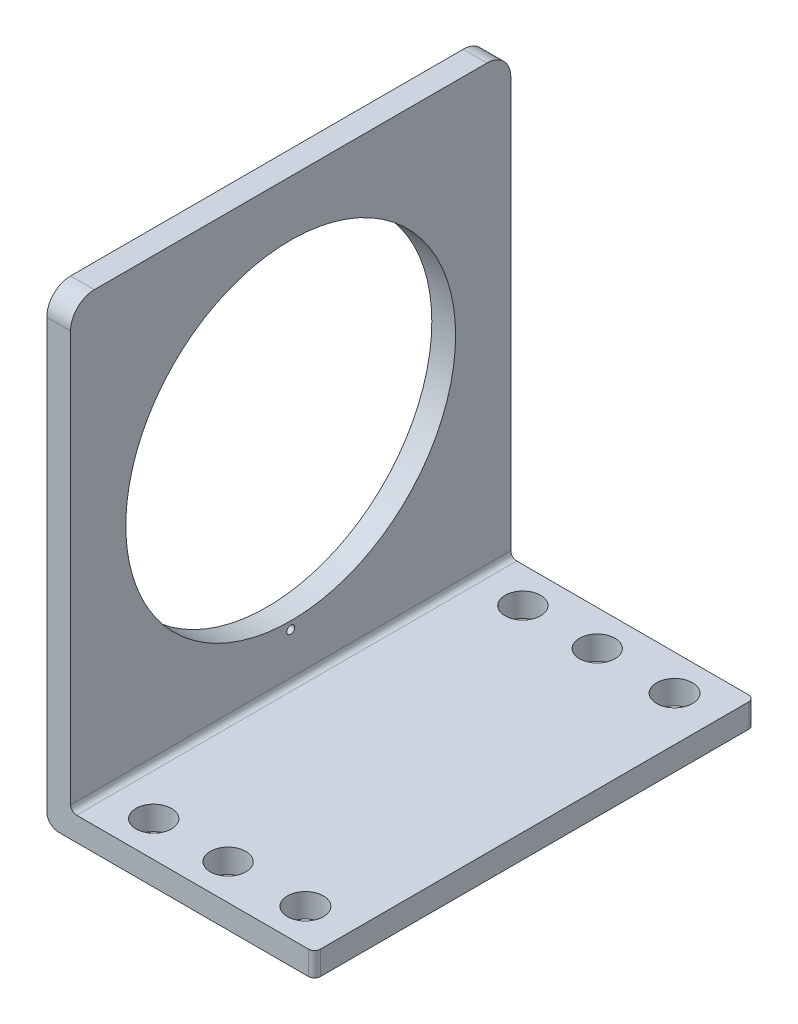
ISO-10303-21;
HEADER;
FILE_DESCRIPTION(('STEP AP214'),'2;1');
FILE_NAME('part.step','',(''),(''),'','','');
FILE_SCHEMA(('AUTOMOTIVE_DESIGN { 1 0 10303 214 1 1 1 1 }'));
ENDSEC;
DATA;
#1=APPLICATION_CONTEXT('core data for automotive mechanical design processes');
#2=APPLICATION_PROTOCOL_DEFINITION('international standard','automotive_design',2000,#1);
#3=PRODUCT_CONTEXT('',#1,'mechanical');
#4=PRODUCT('Part','Part','',(#3));
#5=PRODUCT_RELATED_PRODUCT_CATEGORY('part','',(#4));
#6=PRODUCT_DEFINITION_FORMATION('','',#4);
#7=PRODUCT_DEFINITION_CONTEXT('part definition',#1,'design');
#8=PRODUCT_DEFINITION('design','',#6,#7);
#9=PRODUCT_DEFINITION_SHAPE('','',#8);
#10=(LENGTH_UNIT() NAMED_UNIT(*) SI_UNIT(.MILLI.,.METRE.));
#11=(NAMED_UNIT(*) PLANE_ANGLE_UNIT() SI_UNIT($,.RADIAN.));
#12=(NAMED_UNIT(*) SI_UNIT($,.STERADIAN.) SOLID_ANGLE_UNIT());
#13=UNCERTAINTY_MEASURE_WITH_UNIT(LENGTH_MEASURE(1.E-05),#10,'distance_accuracy_value','');
#14=(GEOMETRIC_REPRESENTATION_CONTEXT(3) GLOBAL_UNCERTAINTY_ASSIGNED_CONTEXT((#13)) GLOBAL_UNIT_ASSIGNED_CONTEXT((#10,
#11,#12)) REPRESENTATION_CONTEXT('',''));
#15=CARTESIAN_POINT('',(0.,0.,0.));
#16=DIRECTION('',(0.,0.,1.));
#17=DIRECTION('',(1.,0.,0.));
#18=AXIS2_PLACEMENT_3D('',#15,#16,#17);
#19=CARTESIAN_POINT('',(20.5,0.,37.));
#20=DIRECTION('',(0.,-1.,0.));
#21=DIRECTION('',(0.,0.,-1.));
#22=AXIS2_PLACEMENT_3D('',#19,#20,#21);
#23=PLANE('',#22);
#24=CARTESIAN_POINT('',(4.00000000000002,0.,34.0129711059131));
#25=DIRECTION('',(0.,1.,0.));
#26=DIRECTION('',(0.,0.,-1.));
#27=AXIS2_PLACEMENT_3D('',#24,#25,#26);
#28=CIRCLE('',#27,1.49522613069043);
#29=CARTESIAN_POINT('',(4.00000000000002,0.,32.5177449752227));
#30=VERTEX_POINT('',#29);
#31=EDGE_CURVE('E237',#30,#30,#28,.T.);
#32=ORIENTED_EDGE('',*,*,#31,.F.);
#33=EDGE_LOOP('',(#32));
#34=FACE_BOUND('',#33,.T.);
#35=CARTESIAN_POINT('',(10.25,0.,34.0129711059131));
#36=DIRECTION('',(0.,1.,0.));
#37=DIRECTION('',(0.,0.,-1.));
#38=AXIS2_PLACEMENT_3D('',#35,#36,#37);
#39=CIRCLE('',#38,1.49522613069043);
#40=CARTESIAN_POINT('',(10.25,0.,32.5177449752227));
#41=VERTEX_POINT('',#40);
#42=EDGE_CURVE('E232',#41,#41,#39,.T.);
#43=ORIENTED_EDGE('',*,*,#42,.F.);
#44=EDGE_LOOP('',(#43));
#45=FACE_BOUND('',#44,.T.);
#46=CARTESIAN_POINT('',(16.75,0.,34.0129711059131));
#47=DIRECTION('',(0.,1.,0.));
#48=DIRECTION('',(0.,0.,-1.));
#49=AXIS2_PLACEMENT_3D('',#46,#47,#48);
#50=CIRCLE('',#49,1.51380108054096);
#51=CARTESIAN_POINT('',(16.75,0.,32.4991700253722));
#52=VERTEX_POINT('',#51);
#53=EDGE_CURVE('E227',#52,#52,#50,.T.);
#54=ORIENTED_EDGE('',*,*,#53,.F.);
#55=EDGE_LOOP('',(#54));
#56=FACE_BOUND('',#55,.T.);
#57=CARTESIAN_POINT('',(4.00000000000001,0.,2.98702889408689));
#58=DIRECTION('',(0.,1.,0.));
#59=DIRECTION('',(0.,0.,1.));
#60=AXIS2_PLACEMENT_3D('',#57,#58,#59);
#61=CIRCLE('',#60,1.49522613069043);
#62=CARTESIAN_POINT('',(4.00000000000001,0.,4.48225502477732));
#63=VERTEX_POINT('',#62);
#64=EDGE_CURVE('E222',#63,#63,#61,.T.);
#65=ORIENTED_EDGE('',*,*,#64,.F.);
#66=EDGE_LOOP('',(#65));
#67=FACE_BOUND('',#66,.T.);
#68=CARTESIAN_POINT('',(10.25,0.,2.98702889408689));
#69=DIRECTION('',(0.,1.,0.));
#70=DIRECTION('',(0.,0.,1.));
#71=AXIS2_PLACEMENT_3D('',#68,#69,#70);
#72=CIRCLE('',#71,1.49522613069043);
#73=CARTESIAN_POINT('',(10.25,0.,4.48225502477732));
#74=VERTEX_POINT('',#73);
#75=EDGE_CURVE('E217',#74,#74,#72,.T.);
#76=ORIENTED_EDGE('',*,*,#75,.F.);
#77=EDGE_LOOP('',(#76));
#78=FACE_BOUND('',#77,.T.);
#79=CARTESIAN_POINT('',(16.75,0.,2.98702889408689));
#80=DIRECTION('',(0.,1.,0.));
#81=DIRECTION('',(0.,0.,1.));
#82=AXIS2_PLACEMENT_3D('',#79,#80,#81);
#83=CIRCLE('',#82,1.51380108054096);
#84=CARTESIAN_POINT('',(16.75,0.,4.50082997462785));
#85=VERTEX_POINT('',#84);
#86=EDGE_CURVE('E212',#85,#85,#83,.T.);
#87=ORIENTED_EDGE('',*,*,#86,.F.);
#88=EDGE_LOOP('',(#87));
#89=FACE_BOUND('',#88,.T.);
#90=DIRECTION('',(0.,0.,-1.));
#91=VECTOR('',#90,1.);
#92=CARTESIAN_POINT('',(20.5,0.,37.));
#93=LINE('',#92,#91);
#94=CARTESIAN_POINT('',(20.5,0.,36.5));
#95=VERTEX_POINT('',#94);
#96=CARTESIAN_POINT('',(20.5,0.,0.5));
#97=VERTEX_POINT('',#96);
#98=EDGE_CURVE('E163',#95,#97,#93,.T.);
#99=ORIENTED_EDGE('',*,*,#98,.T.);
#100=CARTESIAN_POINT('',(20.,0.,0.5));
#101=DIRECTION('',(0.,-1.,0.));
#102=DIRECTION('',(0.,0.,-1.));
#103=AXIS2_PLACEMENT_3D('',#100,#101,#102);
#104=CIRCLE('',#103,0.5);
#105=CARTESIAN_POINT('',(20.,0.,0.));
#106=VERTEX_POINT('',#105);
#107=EDGE_CURVE('E288',#97,#106,#104,.F.);
#108=ORIENTED_EDGE('',*,*,#107,.T.);
#109=DIRECTION('',(-1.,0.,0.));
#110=VECTOR('',#109,1.);
#111=CARTESIAN_POINT('',(20.5,0.,0.));
#112=LINE('',#111,#110);
#113=CARTESIAN_POINT('',(0.500000000000007,0.,0.));
#114=VERTEX_POINT('',#113);
#115=EDGE_CURVE('E167',#106,#114,#112,.T.);
#116=ORIENTED_EDGE('',*,*,#115,.T.);
#117=DIRECTION('',(0.,0.,-1.));
#118=VECTOR('',#117,1.);
#119=CARTESIAN_POINT('',(0.5,0.,37.));
#120=LINE('',#119,#118);
#121=CARTESIAN_POINT('',(0.500000000000007,0.,37.));
#122=VERTEX_POINT('',#121);
#123=EDGE_CURVE('E267',#114,#122,#120,.F.);
#124=ORIENTED_EDGE('',*,*,#123,.T.);
#125=DIRECTION('',(-1.,0.,0.));
#126=VECTOR('',#125,1.);
#127=CARTESIAN_POINT('',(20.5,0.,37.));
#128=LINE('',#127,#126);
#129=CARTESIAN_POINT('',(20.,0.,37.));
#130=VERTEX_POINT('',#129);
#131=EDGE_CURVE('E182',#130,#122,#128,.T.);
#132=ORIENTED_EDGE('',*,*,#131,.F.);
#133=CARTESIAN_POINT('',(20.,0.,36.5));
#134=DIRECTION('',(0.,-1.,0.));
#135=DIRECTION('',(0.,0.,-1.));
#136=AXIS2_PLACEMENT_3D('',#133,#134,#135);
#137=CIRCLE('',#136,0.5);
#138=EDGE_CURVE('E285',#130,#95,#137,.F.);
#139=ORIENTED_EDGE('',*,*,#138,.T.);
#140=EDGE_LOOP('',(#99,#108,#116,#124,#132,#139));
#141=FACE_BOUND('',#140,.T.);
#142=ADVANCED_FACE('F39',(#34,#45,#56,#67,#78,#89,#141),#23,.F.);
#143=CARTESIAN_POINT('',(0.,0.,37.));
#144=DIRECTION('',(-1.,0.,0.));
#145=DIRECTION('',(0.,0.,1.));
#146=AXIS2_PLACEMENT_3D('',#143,#144,#145);
#147=PLANE('',#146);
#148=CARTESIAN_POINT('',(0.,4.,18.5));
#149=DIRECTION('',(1.,0.,0.));
#150=DIRECTION('',(0.,0.,-1.));
#151=AXIS2_PLACEMENT_3D('',#148,#149,#150);
#152=CIRCLE('',#151,0.332739378148402);
#153=CARTESIAN_POINT('',(0.,4.,18.1672606218516));
#154=VERTEX_POINT('',#153);
#155=EDGE_CURVE('E207',#154,#154,#152,.T.);
#156=ORIENTED_EDGE('',*,*,#155,.F.);
#157=EDGE_LOOP('',(#156));
#158=FACE_BOUND('',#157,.T.);
#159=CARTESIAN_POINT('',(0.,18.5,18.5));
#160=DIRECTION('',(1.,0.,0.));
#161=DIRECTION('',(0.,0.,-1.));
#162=AXIS2_PLACEMENT_3D('',#159,#160,#161);
#163=CIRCLE('',#162,13.8600559686062);
#164=CARTESIAN_POINT('',(0.,18.5,4.63994403139377));
#165=VERTEX_POINT('',#164);
#166=EDGE_CURVE('E202',#165,#165,#163,.T.);
#167=ORIENTED_EDGE('',*,*,#166,.F.);
#168=EDGE_LOOP('',(#167));
#169=FACE_BOUND('',#168,.T.);
#170=DIRECTION('',(0.,1.,0.));
#171=VECTOR('',#170,1.);
#172=CARTESIAN_POINT('',(0.,0.,37.));
#173=LINE('',#172,#171);
#174=CARTESIAN_POINT('',(0.,0.5,37.));
#175=VERTEX_POINT('',#174);
#176=CARTESIAN_POINT('',(0.,35.,37.));
#177=VERTEX_POINT('',#176);
#178=EDGE_CURVE('E143',#175,#177,#173,.T.);
#179=ORIENTED_EDGE('',*,*,#178,.F.);
#180=DIRECTION('',(0.,0.,-1.));
#181=VECTOR('',#180,1.);
#182=CARTESIAN_POINT('',(0.,0.5,0.));
#183=LINE('',#182,#181);
#184=CARTESIAN_POINT('',(0.,0.5,0.));
#185=VERTEX_POINT('',#184);
#186=EDGE_CURVE('E263',#175,#185,#183,.T.);
#187=ORIENTED_EDGE('',*,*,#186,.T.);
#188=DIRECTION('',(0.,1.,0.));
#189=VECTOR('',#188,1.);
#190=CARTESIAN_POINT('',(0.,0.,0.));
#191=LINE('',#190,#189);
#192=CARTESIAN_POINT('',(0.,35.,0.));
#193=VERTEX_POINT('',#192);
#194=EDGE_CURVE('E170',#185,#193,#191,.T.);
#195=ORIENTED_EDGE('',*,*,#194,.T.);
#196=CARTESIAN_POINT('',(0.,35.,2.));
#197=DIRECTION('',(-1.,0.,0.));
#198=DIRECTION('',(0.,0.,1.));
#199=AXIS2_PLACEMENT_3D('',#196,#197,#198);
#200=CIRCLE('',#199,2.);
#201=CARTESIAN_POINT('',(0.,37.,2.));
#202=VERTEX_POINT('',#201);
#203=EDGE_CURVE('E245',#193,#202,#200,.F.);
#204=ORIENTED_EDGE('',*,*,#203,.T.);
#205=DIRECTION('',(0.,0.,-1.));
#206=VECTOR('',#205,1.);
#207=CARTESIAN_POINT('',(0.,37.,37.));
#208=LINE('',#207,#206);
#209=CARTESIAN_POINT('',(0.,37.,35.));
#210=VERTEX_POINT('',#209);
#211=EDGE_CURVE('E194',#210,#202,#208,.T.);
#212=ORIENTED_EDGE('',*,*,#211,.F.);
#213=CARTESIAN_POINT('',(0.,35.,35.));
#214=DIRECTION('',(-1.,0.,0.));
#215=DIRECTION('',(0.,0.,1.));
#216=AXIS2_PLACEMENT_3D('',#213,#214,#215);
#217=CIRCLE('',#216,2.);
#218=EDGE_CURVE('E241',#210,#177,#217,.F.);
#219=ORIENTED_EDGE('',*,*,#218,.T.);
#220=EDGE_LOOP('',(#179,#187,#195,#204,#212,#219));
#221=FACE_BOUND('',#220,.T.);
#222=ADVANCED_FACE('F347',(#158,#169,#221),#147,.F.);
#223=CARTESIAN_POINT('',(-2.,37.,37.));
#224=DIRECTION('',(0.,1.,0.));
#225=DIRECTION('',(0.,0.,1.));
#226=AXIS2_PLACEMENT_3D('',#223,#224,#225);
#227=PLANE('',#226);
#228=ORIENTED_EDGE('',*,*,#211,.T.);
#229=DIRECTION('',(1.,0.,0.));
#230=VECTOR('',#229,1.);
#231=CARTESIAN_POINT('',(-2.,37.,2.));
#232=LINE('',#231,#230);
#233=CARTESIAN_POINT('',(-2.,37.,2.));
#234=VERTEX_POINT('',#233);
#235=EDGE_CURVE('E252',#202,#234,#232,.F.);
#236=ORIENTED_EDGE('',*,*,#235,.T.);
#237=DIRECTION('',(0.,0.,-1.));
#238=VECTOR('',#237,1.);
#239=CARTESIAN_POINT('',(-2.,37.,37.));
#240=LINE('',#239,#238);
#241=CARTESIAN_POINT('',(-2.,37.,35.));
#242=VERTEX_POINT('',#241);
#243=EDGE_CURVE('E154',#242,#234,#240,.T.);
#244=ORIENTED_EDGE('',*,*,#243,.F.);
#245=DIRECTION('',(1.,0.,0.));
#246=VECTOR('',#245,1.);
#247=CARTESIAN_POINT('',(-2.,37.,35.));
#248=LINE('',#247,#246);
#249=EDGE_CURVE('E248',#242,#210,#248,.T.);
#250=ORIENTED_EDGE('',*,*,#249,.T.);
#251=EDGE_LOOP('',(#228,#236,#244,#250));
#252=FACE_BOUND('',#251,.T.);
#253=ADVANCED_FACE('F381',(#252),#227,.T.);
#254=CARTESIAN_POINT('',(-2.,37.,37.));
#255=DIRECTION('',(1.,0.,0.));
#256=DIRECTION('',(0.,1.,0.));
#257=AXIS2_PLACEMENT_3D('',#254,#255,#256);
#258=PLANE('',#257);
#259=CARTESIAN_POINT('',(-2.,4.,18.5));
#260=DIRECTION('',(1.,0.,0.));
#261=DIRECTION('',(0.,1.,0.));
#262=AXIS2_PLACEMENT_3D('',#259,#260,#261);
#263=CIRCLE('',#262,0.332739378148402);
#264=CARTESIAN_POINT('',(-2.,4.3327393781484,18.5));
#265=VERTEX_POINT('',#264);
#266=EDGE_CURVE('E203',#265,#265,#263,.T.);
#267=ORIENTED_EDGE('',*,*,#266,.T.);
#268=EDGE_LOOP('',(#267));
#269=FACE_BOUND('',#268,.T.);
#270=CARTESIAN_POINT('',(-2.,18.5,18.5));
#271=DIRECTION('',(1.,0.,0.));
#272=DIRECTION('',(0.,1.,0.));
#273=AXIS2_PLACEMENT_3D('',#270,#271,#272);
#274=CIRCLE('',#273,13.8600559686062);
#275=CARTESIAN_POINT('',(-2.,32.3600559686062,18.5));
#276=VERTEX_POINT('',#275);
#277=EDGE_CURVE('E171',#276,#276,#274,.T.);
#278=ORIENTED_EDGE('',*,*,#277,.T.);
#279=EDGE_LOOP('',(#278));
#280=FACE_BOUND('',#279,.T.);
#281=ORIENTED_EDGE('',*,*,#243,.T.);
#282=CARTESIAN_POINT('',(-2.,35.,2.));
#283=DIRECTION('',(1.,0.,0.));
#284=DIRECTION('',(0.,1.,0.));
#285=AXIS2_PLACEMENT_3D('',#282,#283,#284);
#286=CIRCLE('',#285,2.);
#287=CARTESIAN_POINT('',(-2.,35.,0.));
#288=VERTEX_POINT('',#287);
#289=EDGE_CURVE('E258',#234,#288,#286,.F.);
#290=ORIENTED_EDGE('',*,*,#289,.T.);
#291=DIRECTION('',(0.,-1.,0.));
#292=VECTOR('',#291,1.);
#293=CARTESIAN_POINT('',(-2.,37.,0.));
#294=LINE('',#293,#292);
#295=CARTESIAN_POINT('',(-2.,-1.,0.));
#296=VERTEX_POINT('',#295);
#297=EDGE_CURVE('E150',#288,#296,#294,.T.);
#298=ORIENTED_EDGE('',*,*,#297,.T.);
#299=DIRECTION('',(0.,0.,-1.));
#300=VECTOR('',#299,1.);
#301=CARTESIAN_POINT('',(-2.,-1.,37.));
#302=LINE('',#301,#300);
#303=CARTESIAN_POINT('',(-2.,-1.,37.));
#304=VERTEX_POINT('',#303);
#305=EDGE_CURVE('E146',#304,#296,#302,.T.);
#306=ORIENTED_EDGE('',*,*,#305,.F.);
#307=DIRECTION('',(0.,-1.,0.));
#308=VECTOR('',#307,1.);
#309=CARTESIAN_POINT('',(-2.,37.,37.));
#310=LINE('',#309,#308);
#311=CARTESIAN_POINT('',(-2.,35.,37.));
#312=VERTEX_POINT('',#311);
#313=EDGE_CURVE('E132',#312,#304,#310,.T.);
#314=ORIENTED_EDGE('',*,*,#313,.F.);
#315=CARTESIAN_POINT('',(-2.,35.,35.));
#316=DIRECTION('',(1.,0.,0.));
#317=DIRECTION('',(0.,1.,0.));
#318=AXIS2_PLACEMENT_3D('',#315,#316,#317);
#319=CIRCLE('',#318,2.);
#320=EDGE_CURVE('E255',#312,#242,#319,.F.);
#321=ORIENTED_EDGE('',*,*,#320,.T.);
#322=EDGE_LOOP('',(#281,#290,#298,#306,#314,#321));
#323=FACE_BOUND('',#322,.T.);
#324=ADVANCED_FACE('F148',(#269,#280,#323),#258,.F.);
#325=CARTESIAN_POINT('',(-0.999999999999995,-1.,37.));
#326=DIRECTION('',(0.,0.,-1.));
#327=DIRECTION('',(-1.,0.,0.));
#328=AXIS2_PLACEMENT_3D('',#325,#326,#327);
#329=CYLINDRICAL_SURFACE('',#328,1.);
#330=CARTESIAN_POINT('',(-0.999999999999995,-1.,0.));
#331=DIRECTION('',(0.,0.,1.));
#332=DIRECTION('',(1.,0.,0.));
#333=AXIS2_PLACEMENT_3D('',#330,#331,#332);
#334=CIRCLE('',#333,1.);
#335=CARTESIAN_POINT('',(-0.999999999999995,-2.,0.));
#336=VERTEX_POINT('',#335);
#337=EDGE_CURVE('E176',#296,#336,#334,.T.);
#338=ORIENTED_EDGE('',*,*,#337,.T.);
#339=DIRECTION('',(0.,0.,-1.));
#340=VECTOR('',#339,1.);
#341=CARTESIAN_POINT('',(-0.999999999999995,-2.,37.));
#342=LINE('',#341,#340);
#343=CARTESIAN_POINT('',(-0.999999999999995,-2.,37.));
#344=VERTEX_POINT('',#343);
#345=EDGE_CURVE('E155',#344,#336,#342,.T.);
#346=ORIENTED_EDGE('',*,*,#345,.F.);
#347=CARTESIAN_POINT('',(-0.999999999999995,-1.,37.));
#348=DIRECTION('',(0.,0.,1.));
#349=DIRECTION('',(1.,0.,0.));
#350=AXIS2_PLACEMENT_3D('',#347,#348,#349);
#351=CIRCLE('',#350,1.);
#352=EDGE_CURVE('E136',#304,#344,#351,.T.);
#353=ORIENTED_EDGE('',*,*,#352,.F.);
#354=ORIENTED_EDGE('',*,*,#305,.T.);
#355=EDGE_LOOP('',(#338,#346,#353,#354));
#356=FACE_BOUND('',#355,.T.);
#357=ADVANCED_FACE('F157',(#356),#329,.T.);
#358=CARTESIAN_POINT('',(-0.999999999999995,-2.,37.));
#359=DIRECTION('',(0.,1.,0.));
#360=DIRECTION('',(0.,0.,1.));
#361=AXIS2_PLACEMENT_3D('',#358,#359,#360);
#362=PLANE('',#361);
#363=CARTESIAN_POINT('',(4.00000000000002,-2.,34.0129711059131));
#364=DIRECTION('',(0.,1.,0.));
#365=DIRECTION('',(0.,0.,1.));
#366=AXIS2_PLACEMENT_3D('',#363,#364,#365);
#367=CIRCLE('',#366,1.49522613069043);
#368=CARTESIAN_POINT('',(4.00000000000002,-2.,35.5081972366035));
#369=VERTEX_POINT('',#368);
#370=EDGE_CURVE('E233',#369,#369,#367,.T.);
#371=ORIENTED_EDGE('',*,*,#370,.T.);
#372=EDGE_LOOP('',(#371));
#373=FACE_BOUND('',#372,.T.);
#374=CARTESIAN_POINT('',(10.25,-2.,34.0129711059131));
#375=DIRECTION('',(0.,1.,0.));
#376=DIRECTION('',(0.,0.,1.));
#377=AXIS2_PLACEMENT_3D('',#374,#375,#376);
#378=CIRCLE('',#377,1.49522613069043);
#379=CARTESIAN_POINT('',(10.25,-2.,35.5081972366036));
#380=VERTEX_POINT('',#379);
#381=EDGE_CURVE('E228',#380,#380,#378,.T.);
#382=ORIENTED_EDGE('',*,*,#381,.T.);
#383=EDGE_LOOP('',(#382));
#384=FACE_BOUND('',#383,.T.);
#385=CARTESIAN_POINT('',(16.75,-2.,34.0129711059131));
#386=DIRECTION('',(0.,1.,0.));
#387=DIRECTION('',(0.,0.,1.));
#388=AXIS2_PLACEMENT_3D('',#385,#386,#387);
#389=CIRCLE('',#388,1.51380108054096);
#390=CARTESIAN_POINT('',(16.75,-2.,35.5267721864541));
#391=VERTEX_POINT('',#390);
#392=EDGE_CURVE('E223',#391,#391,#389,.T.);
#393=ORIENTED_EDGE('',*,*,#392,.T.);
#394=EDGE_LOOP('',(#393));
#395=FACE_BOUND('',#394,.T.);
#396=CARTESIAN_POINT('',(4.00000000000001,-2.,2.98702889408689));
#397=DIRECTION('',(0.,1.,0.));
#398=DIRECTION('',(0.,0.,1.));
#399=AXIS2_PLACEMENT_3D('',#396,#397,#398);
#400=CIRCLE('',#399,1.49522613069043);
#401=CARTESIAN_POINT('',(4.00000000000001,-2.,4.48225502477732));
#402=VERTEX_POINT('',#401);
#403=EDGE_CURVE('E218',#402,#402,#400,.T.);
#404=ORIENTED_EDGE('',*,*,#403,.T.);
#405=EDGE_LOOP('',(#404));
#406=FACE_BOUND('',#405,.T.);
#407=CARTESIAN_POINT('',(10.25,-2.,2.98702889408689));
#408=DIRECTION('',(0.,1.,0.));
#409=DIRECTION('',(0.,0.,1.));
#410=AXIS2_PLACEMENT_3D('',#407,#408,#409);
#411=CIRCLE('',#410,1.49522613069043);
#412=CARTESIAN_POINT('',(10.25,-2.,4.48225502477732));
#413=VERTEX_POINT('',#412);
#414=EDGE_CURVE('E213',#413,#413,#411,.T.);
#415=ORIENTED_EDGE('',*,*,#414,.T.);
#416=EDGE_LOOP('',(#415));
#417=FACE_BOUND('',#416,.T.);
#418=CARTESIAN_POINT('',(16.75,-2.,2.98702889408689));
#419=DIRECTION('',(0.,1.,0.));
#420=DIRECTION('',(0.,0.,1.));
#421=AXIS2_PLACEMENT_3D('',#418,#419,#420);
#422=CIRCLE('',#421,1.51380108054096);
#423=CARTESIAN_POINT('',(16.75,-2.,4.50082997462785));
#424=VERTEX_POINT('',#423);
#425=EDGE_CURVE('E208',#424,#424,#422,.T.);
#426=ORIENTED_EDGE('',*,*,#425,.T.);
#427=EDGE_LOOP('',(#426));
#428=FACE_BOUND('',#427,.T.);
#429=DIRECTION('',(1.,0.,0.));
#430=VECTOR('',#429,1.);
#431=CARTESIAN_POINT('',(-0.999999999999995,-2.,0.));
#432=LINE('',#431,#430);
#433=CARTESIAN_POINT('',(20.,-2.,0.));
#434=VERTEX_POINT('',#433);
#435=EDGE_CURVE('E179',#336,#434,#432,.T.);
#436=ORIENTED_EDGE('',*,*,#435,.T.);
#437=CARTESIAN_POINT('',(20.,-2.,0.5));
#438=DIRECTION('',(0.,1.,0.));
#439=DIRECTION('',(0.,0.,1.));
#440=AXIS2_PLACEMENT_3D('',#437,#438,#439);
#441=CIRCLE('',#440,0.5);
#442=CARTESIAN_POINT('',(20.5,-2.,0.5));
#443=VERTEX_POINT('',#442);
#444=EDGE_CURVE('E48',#434,#443,#441,.F.);
#445=ORIENTED_EDGE('',*,*,#444,.T.);
#446=DIRECTION('',(0.,0.,-1.));
#447=VECTOR('',#446,1.);
#448=CARTESIAN_POINT('',(20.5,-2.,37.));
#449=LINE('',#448,#447);
#450=CARTESIAN_POINT('',(20.5,-2.,36.5));
#451=VERTEX_POINT('',#450);
#452=EDGE_CURVE('E186',#451,#443,#449,.T.);
#453=ORIENTED_EDGE('',*,*,#452,.F.);
#454=CARTESIAN_POINT('',(20.,-2.,36.5));
#455=DIRECTION('',(0.,1.,0.));
#456=DIRECTION('',(0.,0.,1.));
#457=AXIS2_PLACEMENT_3D('',#454,#455,#456);
#458=CIRCLE('',#457,0.5);
#459=CARTESIAN_POINT('',(20.,-2.,37.));
#460=VERTEX_POINT('',#459);
#461=EDGE_CURVE('E55',#451,#460,#458,.F.);
#462=ORIENTED_EDGE('',*,*,#461,.T.);
#463=DIRECTION('',(1.,0.,0.));
#464=VECTOR('',#463,1.);
#465=CARTESIAN_POINT('',(-0.999999999999995,-2.,37.));
#466=LINE('',#465,#464);
#467=EDGE_CURVE('E160',#344,#460,#466,.T.);
#468=ORIENTED_EDGE('',*,*,#467,.F.);
#469=ORIENTED_EDGE('',*,*,#345,.T.);
#470=EDGE_LOOP('',(#436,#445,#453,#462,#468,#469));
#471=FACE_BOUND('',#470,.T.);
#472=ADVANCED_FACE('F296',(#373,#384,#395,#406,#417,#428,#471),#362,.F.);
#473=CARTESIAN_POINT('',(20.5,-2.,37.));
#474=DIRECTION('',(-1.,0.,0.));
#475=DIRECTION('',(0.,0.,1.));
#476=AXIS2_PLACEMENT_3D('',#473,#474,#475);
#477=PLANE('',#476);
#478=ORIENTED_EDGE('',*,*,#452,.T.);
#479=DIRECTION('',(0.,1.,0.));
#480=VECTOR('',#479,1.);
#481=CARTESIAN_POINT('',(20.5,-2.,0.5));
#482=LINE('',#481,#480);
#483=EDGE_CURVE('E281',#443,#97,#482,.T.);
#484=ORIENTED_EDGE('',*,*,#483,.T.);
#485=ORIENTED_EDGE('',*,*,#98,.F.);
#486=DIRECTION('',(0.,1.,0.));
#487=VECTOR('',#486,1.);
#488=CARTESIAN_POINT('',(20.5,-2.,36.5));
#489=LINE('',#488,#487);
#490=EDGE_CURVE('E278',#95,#451,#489,.F.);
#491=ORIENTED_EDGE('',*,*,#490,.T.);
#492=EDGE_LOOP('',(#478,#484,#485,#491));
#493=FACE_BOUND('',#492,.T.);
#494=ADVANCED_FACE('F300',(#493),#477,.F.);
#495=CARTESIAN_POINT('',(-0.999999999999995,-1.,37.));
#496=DIRECTION('',(0.,0.,1.));
#497=DIRECTION('',(1.,0.,0.));
#498=AXIS2_PLACEMENT_3D('',#495,#496,#497);
#499=PLANE('',#498);
#500=ORIENTED_EDGE('',*,*,#467,.T.);
#501=DIRECTION('',(0.,1.,0.));
#502=VECTOR('',#501,1.);
#503=CARTESIAN_POINT('',(20.,0.,37.));
#504=LINE('',#503,#502);
#505=EDGE_CURVE('E11',#460,#130,#504,.T.);
#506=ORIENTED_EDGE('',*,*,#505,.T.);
#507=ORIENTED_EDGE('',*,*,#131,.T.);
#508=CARTESIAN_POINT('',(0.5,0.5,37.));
#509=DIRECTION('',(0.,0.,1.));
#510=DIRECTION('',(1.,0.,0.));
#511=AXIS2_PLACEMENT_3D('',#508,#509,#510);
#512=CIRCLE('',#511,0.5);
#513=EDGE_CURVE('E275',#122,#175,#512,.F.);
#514=ORIENTED_EDGE('',*,*,#513,.T.);
#515=ORIENTED_EDGE('',*,*,#178,.T.);
#516=DIRECTION('',(1.,0.,0.));
#517=VECTOR('',#516,1.);
#518=CARTESIAN_POINT('',(-0.999999999999995,35.,37.));
#519=LINE('',#518,#517);
#520=EDGE_CURVE('E139',#177,#312,#519,.F.);
#521=ORIENTED_EDGE('',*,*,#520,.T.);
#522=ORIENTED_EDGE('',*,*,#313,.T.);
#523=ORIENTED_EDGE('',*,*,#352,.T.);
#524=EDGE_LOOP('',(#500,#506,#507,#514,#515,#521,#522,#523));
#525=FACE_BOUND('',#524,.T.);
#526=ADVANCED_FACE('F134',(#525),#499,.T.);
#527=CARTESIAN_POINT('',(-0.999999999999995,-1.,0.));
#528=DIRECTION('',(0.,0.,1.));
#529=DIRECTION('',(1.,0.,0.));
#530=AXIS2_PLACEMENT_3D('',#527,#528,#529);
#531=PLANE('',#530);
#532=ORIENTED_EDGE('',*,*,#115,.F.);
#533=DIRECTION('',(0.,1.,0.));
#534=VECTOR('',#533,1.);
#535=CARTESIAN_POINT('',(20.,-1.,0.));
#536=LINE('',#535,#534);
#537=EDGE_CURVE('E63',#106,#434,#536,.F.);
#538=ORIENTED_EDGE('',*,*,#537,.T.);
#539=ORIENTED_EDGE('',*,*,#435,.F.);
#540=ORIENTED_EDGE('',*,*,#337,.F.);
#541=ORIENTED_EDGE('',*,*,#297,.F.);
#542=DIRECTION('',(1.,0.,0.));
#543=VECTOR('',#542,1.);
#544=CARTESIAN_POINT('',(0.,35.,0.));
#545=LINE('',#544,#543);
#546=EDGE_CURVE('E198',#288,#193,#545,.T.);
#547=ORIENTED_EDGE('',*,*,#546,.T.);
#548=ORIENTED_EDGE('',*,*,#194,.F.);
#549=CARTESIAN_POINT('',(0.5,0.5,0.));
#550=DIRECTION('',(0.,0.,1.));
#551=DIRECTION('',(1.,0.,0.));
#552=AXIS2_PLACEMENT_3D('',#549,#550,#551);
#553=CIRCLE('',#552,0.5);
#554=EDGE_CURVE('E271',#185,#114,#553,.T.);
#555=ORIENTED_EDGE('',*,*,#554,.T.);
#556=EDGE_LOOP('',(#532,#538,#539,#540,#541,#547,#548,#555));
#557=FACE_BOUND('',#556,.T.);
#558=ADVANCED_FACE('F305',(#557),#531,.F.);
#559=CARTESIAN_POINT('',(-10.,18.5,18.5));
#560=DIRECTION('',(1.,0.,0.));
#561=DIRECTION('',(0.,0.,-1.));
#562=AXIS2_PLACEMENT_3D('',#559,#560,#561);
#563=CYLINDRICAL_SURFACE('',#562,13.8600559686062);
#564=ORIENTED_EDGE('',*,*,#166,.T.);
#565=EDGE_LOOP('',(#564));
#566=FACE_BOUND('',#565,.T.);
#567=ORIENTED_EDGE('',*,*,#277,.F.);
#568=EDGE_LOOP('',(#567));
#569=FACE_BOUND('',#568,.T.);
#570=ADVANCED_FACE('F428',(#566,#569),#563,.F.);
#571=CARTESIAN_POINT('',(-10.,4.,18.5));
#572=DIRECTION('',(1.,0.,0.));
#573=DIRECTION('',(0.,0.,-1.));
#574=AXIS2_PLACEMENT_3D('',#571,#572,#573);
#575=CYLINDRICAL_SURFACE('',#574,0.332739378148402);
#576=ORIENTED_EDGE('',*,*,#155,.T.);
#577=EDGE_LOOP('',(#576));
#578=FACE_BOUND('',#577,.T.);
#579=ORIENTED_EDGE('',*,*,#266,.F.);
#580=EDGE_LOOP('',(#579));
#581=FACE_BOUND('',#580,.T.);
#582=ADVANCED_FACE('F363',(#578,#581),#575,.F.);
#583=CARTESIAN_POINT('',(16.75,-10.,2.98702889408689));
#584=DIRECTION('',(0.,1.,0.));
#585=DIRECTION('',(0.,0.,1.));
#586=AXIS2_PLACEMENT_3D('',#583,#584,#585);
#587=CYLINDRICAL_SURFACE('',#586,1.51380108054096);
#588=ORIENTED_EDGE('',*,*,#86,.T.);
#589=EDGE_LOOP('',(#588));
#590=FACE_BOUND('',#589,.T.);
#591=ORIENTED_EDGE('',*,*,#425,.F.);
#592=EDGE_LOOP('',(#591));
#593=FACE_BOUND('',#592,.T.);
#594=ADVANCED_FACE('F359',(#590,#593),#587,.F.);
#595=CARTESIAN_POINT('',(10.25,-10.,2.98702889408689));
#596=DIRECTION('',(0.,1.,0.));
#597=DIRECTION('',(0.,0.,1.));
#598=AXIS2_PLACEMENT_3D('',#595,#596,#597);
#599=CYLINDRICAL_SURFACE('',#598,1.49522613069043);
#600=ORIENTED_EDGE('',*,*,#75,.T.);
#601=EDGE_LOOP('',(#600));
#602=FACE_BOUND('',#601,.T.);
#603=ORIENTED_EDGE('',*,*,#414,.F.);
#604=EDGE_LOOP('',(#603));
#605=FACE_BOUND('',#604,.T.);
#606=ADVANCED_FACE('F362',(#602,#605),#599,.F.);
#607=CARTESIAN_POINT('',(4.00000000000001,-10.,2.98702889408689));
#608=DIRECTION('',(0.,1.,0.));
#609=DIRECTION('',(0.,0.,1.));
#610=AXIS2_PLACEMENT_3D('',#607,#608,#609);
#611=CYLINDRICAL_SURFACE('',#610,1.49522613069043);
#612=ORIENTED_EDGE('',*,*,#64,.T.);
#613=EDGE_LOOP('',(#612));
#614=FACE_BOUND('',#613,.T.);
#615=ORIENTED_EDGE('',*,*,#403,.F.);
#616=EDGE_LOOP('',(#615));
#617=FACE_BOUND('',#616,.T.);
#618=ADVANCED_FACE('F508',(#614,#617),#611,.F.);
#619=CARTESIAN_POINT('',(16.75,-10.,34.0129711059131));
#620=DIRECTION('',(0.,1.,0.));
#621=DIRECTION('',(0.,0.,1.));
#622=AXIS2_PLACEMENT_3D('',#619,#620,#621);
#623=CYLINDRICAL_SURFACE('',#622,1.51380108054096);
#624=ORIENTED_EDGE('',*,*,#53,.T.);
#625=EDGE_LOOP('',(#624));
#626=FACE_BOUND('',#625,.T.);
#627=ORIENTED_EDGE('',*,*,#392,.F.);
#628=EDGE_LOOP('',(#627));
#629=FACE_BOUND('',#628,.T.);
#630=ADVANCED_FACE('F500',(#626,#629),#623,.F.);
#631=CARTESIAN_POINT('',(10.25,-10.,34.0129711059131));
#632=DIRECTION('',(0.,1.,0.));
#633=DIRECTION('',(0.,0.,1.));
#634=AXIS2_PLACEMENT_3D('',#631,#632,#633);
#635=CYLINDRICAL_SURFACE('',#634,1.49522613069043);
#636=ORIENTED_EDGE('',*,*,#42,.T.);
#637=EDGE_LOOP('',(#636));
#638=FACE_BOUND('',#637,.T.);
#639=ORIENTED_EDGE('',*,*,#381,.F.);
#640=EDGE_LOOP('',(#639));
#641=FACE_BOUND('',#640,.T.);
#642=ADVANCED_FACE('F493',(#638,#641),#635,.F.);
#643=CARTESIAN_POINT('',(4.00000000000002,-10.,34.0129711059131));
#644=DIRECTION('',(0.,1.,0.));
#645=DIRECTION('',(0.,0.,1.));
#646=AXIS2_PLACEMENT_3D('',#643,#644,#645);
#647=CYLINDRICAL_SURFACE('',#646,1.49522613069043);
#648=ORIENTED_EDGE('',*,*,#31,.T.);
#649=EDGE_LOOP('',(#648));
#650=FACE_BOUND('',#649,.T.);
#651=ORIENTED_EDGE('',*,*,#370,.F.);
#652=EDGE_LOOP('',(#651));
#653=FACE_BOUND('',#652,.T.);
#654=ADVANCED_FACE('F342',(#650,#653),#647,.F.);
#655=CARTESIAN_POINT('',(-0.999999999999995,35.,2.));
#656=DIRECTION('',(-1.,0.,0.));
#657=DIRECTION('',(0.,0.,1.));
#658=AXIS2_PLACEMENT_3D('',#655,#656,#657);
#659=CYLINDRICAL_SURFACE('',#658,2.);
#660=ORIENTED_EDGE('',*,*,#289,.F.);
#661=ORIENTED_EDGE('',*,*,#235,.F.);
#662=ORIENTED_EDGE('',*,*,#203,.F.);
#663=ORIENTED_EDGE('',*,*,#546,.F.);
#664=EDGE_LOOP('',(#660,#661,#662,#663));
#665=FACE_BOUND('',#664,.T.);
#666=ADVANCED_FACE('F389',(#665),#659,.T.);
#667=CARTESIAN_POINT('',(-2.,35.,35.));
#668=DIRECTION('',(1.,0.,0.));
#669=DIRECTION('',(0.,0.,-1.));
#670=AXIS2_PLACEMENT_3D('',#667,#668,#669);
#671=CYLINDRICAL_SURFACE('',#670,2.);
#672=ORIENTED_EDGE('',*,*,#320,.F.);
#673=ORIENTED_EDGE('',*,*,#520,.F.);
#674=ORIENTED_EDGE('',*,*,#218,.F.);
#675=ORIENTED_EDGE('',*,*,#249,.F.);
#676=EDGE_LOOP('',(#672,#673,#674,#675));
#677=FACE_BOUND('',#676,.T.);
#678=ADVANCED_FACE('F392',(#677),#671,.T.);
#679=CARTESIAN_POINT('',(0.5,0.5,37.));
#680=DIRECTION('',(0.,0.,1.));
#681=DIRECTION('',(1.,0.,0.));
#682=AXIS2_PLACEMENT_3D('',#679,#680,#681);
#683=CYLINDRICAL_SURFACE('',#682,0.5);
#684=ORIENTED_EDGE('',*,*,#513,.F.);
#685=ORIENTED_EDGE('',*,*,#123,.F.);
#686=ORIENTED_EDGE('',*,*,#554,.F.);
#687=ORIENTED_EDGE('',*,*,#186,.F.);
#688=EDGE_LOOP('',(#684,#685,#686,#687));
#689=FACE_BOUND('',#688,.T.);
#690=ADVANCED_FACE('F311',(#689),#683,.F.);
#691=CARTESIAN_POINT('',(20.,-2.,0.5));
#692=DIRECTION('',(0.,1.,0.));
#693=DIRECTION('',(0.,0.,1.));
#694=AXIS2_PLACEMENT_3D('',#691,#692,#693);
#695=CYLINDRICAL_SURFACE('',#694,0.5);
#696=ORIENTED_EDGE('',*,*,#444,.F.);
#697=ORIENTED_EDGE('',*,*,#537,.F.);
#698=ORIENTED_EDGE('',*,*,#107,.F.);
#699=ORIENTED_EDGE('',*,*,#483,.F.);
#700=EDGE_LOOP('',(#696,#697,#698,#699));
#701=FACE_BOUND('',#700,.T.);
#702=ADVANCED_FACE('F303',(#701),#695,.T.);
#703=CARTESIAN_POINT('',(20.,-1.,36.5));
#704=DIRECTION('',(0.,-1.,0.));
#705=DIRECTION('',(0.,0.,-1.));
#706=AXIS2_PLACEMENT_3D('',#703,#704,#705);
#707=CYLINDRICAL_SURFACE('',#706,0.5);
#708=ORIENTED_EDGE('',*,*,#461,.F.);
#709=ORIENTED_EDGE('',*,*,#490,.F.);
#710=ORIENTED_EDGE('',*,*,#138,.F.);
#711=ORIENTED_EDGE('',*,*,#505,.F.);
#712=EDGE_LOOP('',(#708,#709,#710,#711));
#713=FACE_BOUND('',#712,.T.);
#714=ADVANCED_FACE('F41',(#713),#707,.T.);
#715=CLOSED_SHELL('',(#142,#222,#253,#324,#357,#472,#494,#526,#558,#570,#582,#594,#606,#618,
#630,#642,#654,#666,#678,#690,#702,#714));
#716=MANIFOLD_SOLID_BREP('B2',#715);
#717=ADVANCED_BREP_SHAPE_REPRESENTATION('',(#18,#716),#14);
#718=SHAPE_DEFINITION_REPRESENTATION(#9,#717);
ENDSEC;
END-ISO-10303-21;
